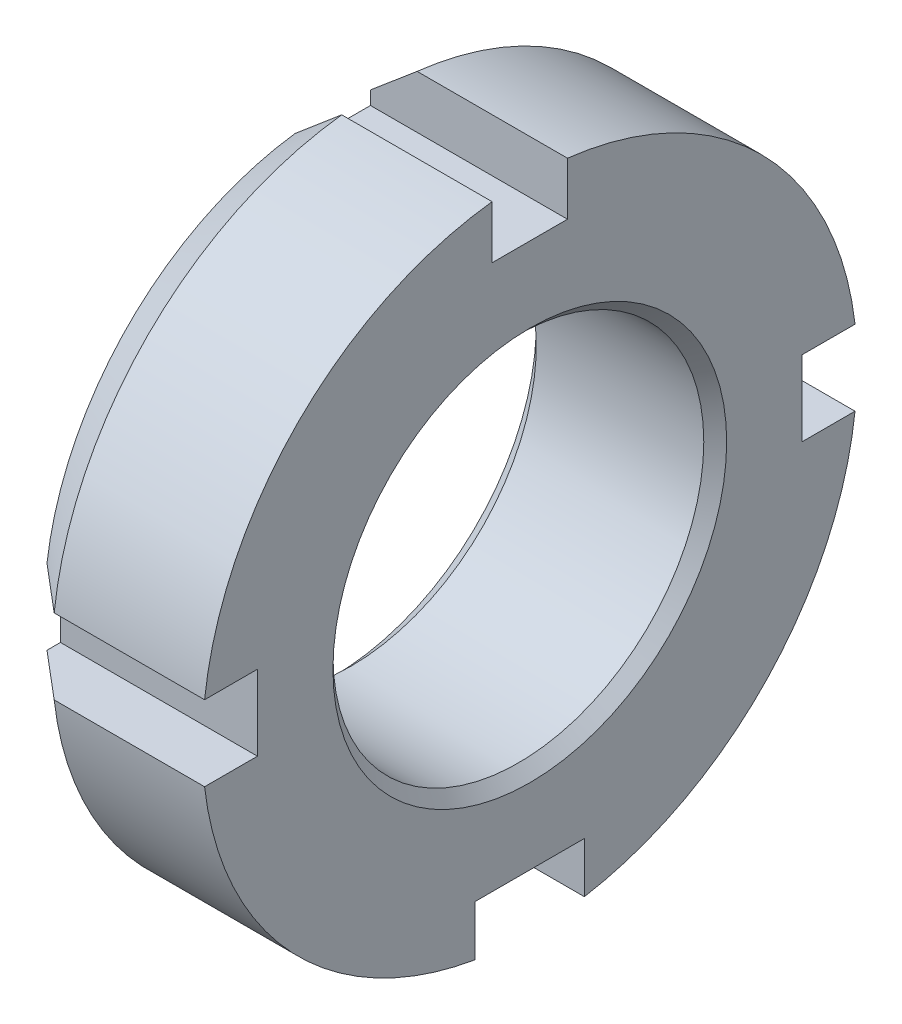
ISO-10303-21;
HEADER;
FILE_DESCRIPTION(('STEP AP214'),'2;1');
FILE_NAME('part.step','',(''),(''),'','','');
FILE_SCHEMA(('AUTOMOTIVE_DESIGN { 1 0 10303 214 1 1 1 1 }'));
ENDSEC;
DATA;
#1=APPLICATION_CONTEXT('core data for automotive mechanical design processes');
#2=APPLICATION_PROTOCOL_DEFINITION('international standard','automotive_design',2000,#1);
#3=PRODUCT_CONTEXT('',#1,'mechanical');
#4=PRODUCT('Part','Part','',(#3));
#5=PRODUCT_RELATED_PRODUCT_CATEGORY('part','',(#4));
#6=PRODUCT_DEFINITION_FORMATION('','',#4);
#7=PRODUCT_DEFINITION_CONTEXT('part definition',#1,'design');
#8=PRODUCT_DEFINITION('design','',#6,#7);
#9=PRODUCT_DEFINITION_SHAPE('','',#8);
#10=(LENGTH_UNIT() NAMED_UNIT(*) SI_UNIT(.MILLI.,.METRE.));
#11=(NAMED_UNIT(*) PLANE_ANGLE_UNIT() SI_UNIT($,.RADIAN.));
#12=(NAMED_UNIT(*) SI_UNIT($,.STERADIAN.) SOLID_ANGLE_UNIT());
#13=UNCERTAINTY_MEASURE_WITH_UNIT(LENGTH_MEASURE(1.E-05),#10,'distance_accuracy_value','');
#14=(GEOMETRIC_REPRESENTATION_CONTEXT(3) GLOBAL_UNCERTAINTY_ASSIGNED_CONTEXT((#13)) GLOBAL_UNIT_ASSIGNED_CONTEXT((#10,
#11,#12)) REPRESENTATION_CONTEXT('',''));
#15=CARTESIAN_POINT('',(0.,0.,0.));
#16=DIRECTION('',(0.,0.,1.));
#17=DIRECTION('',(1.,0.,0.));
#18=AXIS2_PLACEMENT_3D('',#15,#16,#17);
#19=CARTESIAN_POINT('',(0.,0.,0.));
#20=DIRECTION('',(1.,0.,0.));
#21=DIRECTION('',(0.,0.,-1.));
#22=AXIS2_PLACEMENT_3D('',#19,#20,#21);
#23=PLANE('',#22);
#24=CARTESIAN_POINT('',(0.,0.,0.));
#25=DIRECTION('',(-1.,0.,0.));
#26=DIRECTION('',(0.,0.,1.));
#27=AXIS2_PLACEMENT_3D('',#24,#25,#26);
#28=CIRCLE('',#27,2.54);
#29=CARTESIAN_POINT('',(0.,0.,2.54));
#30=VERTEX_POINT('',#29);
#31=EDGE_CURVE('P0_E17',#30,#30,#28,.F.);
#32=ORIENTED_EDGE('',*,*,#31,.F.);
#33=EDGE_LOOP('',(#32));
#34=FACE_BOUND('',#33,.T.);
#35=ADVANCED_FACE('P0_F14',(#34),#23,.F.);
#36=CARTESIAN_POINT('',(0.254,0.,0.));
#37=DIRECTION('',(-1.,0.,0.));
#38=DIRECTION('',(0.,0.,1.));
#39=AXIS2_PLACEMENT_3D('',#36,#37,#38);
#40=CYLINDRICAL_SURFACE('',#39,2.54);
#41=ORIENTED_EDGE('',*,*,#31,.T.);
#42=EDGE_LOOP('',(#41));
#43=FACE_BOUND('',#42,.T.);
#44=CARTESIAN_POINT('',(0.254,0.,0.));
#45=DIRECTION('',(-1.,0.,0.));
#46=DIRECTION('',(0.,0.,1.));
#47=AXIS2_PLACEMENT_3D('',#44,#45,#46);
#48=CIRCLE('',#47,2.54);
#49=CARTESIAN_POINT('',(0.254,0.,2.54));
#50=VERTEX_POINT('',#49);
#51=EDGE_CURVE('P0_E10',#50,#50,#48,.F.);
#52=ORIENTED_EDGE('',*,*,#51,.F.);
#53=EDGE_LOOP('',(#52));
#54=FACE_BOUND('',#53,.T.);
#55=ADVANCED_FACE('P0_F26',(#43,#54),#40,.T.);
#56=CARTESIAN_POINT('',(0.254,0.,0.));
#57=DIRECTION('',(1.,0.,0.));
#58=DIRECTION('',(0.,0.,-1.));
#59=AXIS2_PLACEMENT_3D('',#56,#57,#58);
#60=PLANE('',#59);
#61=ORIENTED_EDGE('',*,*,#51,.T.);
#62=EDGE_LOOP('',(#61));
#63=FACE_BOUND('',#62,.T.);
#64=ADVANCED_FACE('P0_F34',(#63),#60,.T.);
#65=CLOSED_SHELL('',(#35,#55,#64));
#66=MANIFOLD_SOLID_BREP('P0_B1',#65);
#67=CARTESIAN_POINT('',(0.,0.,0.));
#68=DIRECTION('',(-1.,0.,0.));
#69=DIRECTION('',(0.,-1.,0.));
#70=AXIS2_PLACEMENT_3D('',#67,#68,#69);
#71=CONICAL_SURFACE('',#70,8.92175000000001,0.785398163397454);
#72=CARTESIAN_POINT('',(0.,0.,0.));
#73=DIRECTION('',(-1.,0.,0.));
#74=DIRECTION('',(0.,-1.,0.));
#75=AXIS2_PLACEMENT_3D('',#72,#73,#74);
#76=CIRCLE('',#75,8.92175000000001);
#77=CARTESIAN_POINT('',(0.,-8.92175000000001,0.));
#78=VERTEX_POINT('',#77);
#79=EDGE_CURVE('P1_E202',#78,#78,#76,.T.);
#80=ORIENTED_EDGE('',*,*,#79,.T.);
#81=EDGE_LOOP('',(#80));
#82=FACE_BOUND('',#81,.T.);
#83=CARTESIAN_POINT('',(0.793750000000002,0.,0.));
#84=DIRECTION('',(-1.,0.,0.));
#85=DIRECTION('',(0.,0.,1.));
#86=AXIS2_PLACEMENT_3D('',#83,#84,#85);
#87=CIRCLE('',#86,8.128);
#88=CARTESIAN_POINT('',(0.793750000000002,0.,8.128));
#89=VERTEX_POINT('',#88);
#90=EDGE_CURVE('P1_E263',#89,#89,#87,.F.);
#91=ORIENTED_EDGE('',*,*,#90,.T.);
#92=EDGE_LOOP('',(#91));
#93=FACE_BOUND('',#92,.T.);
#94=ADVANCED_FACE('P1_F16',(#82,#93),#71,.F.);
#95=CARTESIAN_POINT('',(2.04326153450278,0.,0.));
#96=DIRECTION('',(1.,0.,0.));
#97=DIRECTION('',(0.,1.,0.));
#98=AXIS2_PLACEMENT_3D('',#95,#96,#97);
#99=CONICAL_SURFACE('',#98,14.351,0.698131700797725);
#100=CARTESIAN_POINT('',(0.,0.,0.));
#101=DIRECTION('',(1.,0.,0.));
#102=DIRECTION('',(0.,1.,0.));
#103=AXIS2_PLACEMENT_3D('',#100,#101,#102);
#104=CIRCLE('',#103,12.6365);
#105=CARTESIAN_POINT('',(0.,12.5281814821626,1.651));
#106=VERTEX_POINT('',#105);
#107=CARTESIAN_POINT('',(0.,1.651,12.5281814821626));
#108=VERTEX_POINT('',#107);
#109=EDGE_CURVE('P1_E203',#106,#108,#104,.T.);
#110=ORIENTED_EDGE('',*,*,#109,.T.);
#111=CARTESIAN_POINT('',(0.,1.651,12.5281814821625));
#112=CARTESIAN_POINT('',(0.340405958390028,1.651,12.8162664626746));
#113=CARTESIAN_POINT('',(0.680880732745143,1.651,13.1042700502399));
#114=CARTESIAN_POINT('',(1.36196791091373,1.651,13.6801144373874));
#115=CARTESIAN_POINT('',(1.70258031472621,1.651,13.9679552369708));
#116=CARTESIAN_POINT('',(2.04326153450278,1.651,14.2557146436087));
#117=B_SPLINE_CURVE_WITH_KNOTS('',3,(#111,#112,#113,#114,#115,#116),.UNSPECIFIED.,.F.,.F.,(4,2,
4),(0.,1.33784238451476,2.67568475931881),.UNSPECIFIED.);
#118=CARTESIAN_POINT('',(2.04326153450278,1.651,14.2557146436087));
#119=VERTEX_POINT('',#118);
#120=EDGE_CURVE('P1_E173',#108,#119,#117,.T.);
#121=ORIENTED_EDGE('',*,*,#120,.T.);
#122=CARTESIAN_POINT('',(2.04326153450278,0.,0.));
#123=DIRECTION('',(-1.,0.,0.));
#124=DIRECTION('',(0.,0.,1.));
#125=AXIS2_PLACEMENT_3D('',#122,#123,#124);
#126=CIRCLE('',#125,14.351);
#127=CARTESIAN_POINT('',(2.04326153450278,14.2557146436087,1.651));
#128=VERTEX_POINT('',#127);
#129=EDGE_CURVE('P1_E252',#128,#119,#126,.F.);
#130=ORIENTED_EDGE('',*,*,#129,.F.);
#131=CARTESIAN_POINT('',(2.04326153450278,14.2557146436087,1.651));
#132=CARTESIAN_POINT('',(1.70258031472621,13.9679552369708,1.651));
#133=CARTESIAN_POINT('',(1.36196791091374,13.6801144373875,1.651));
#134=CARTESIAN_POINT('',(0.680880732745155,13.1042700502399,1.651));
#135=CARTESIAN_POINT('',(0.340405958390043,12.8162664626746,1.651));
#136=CARTESIAN_POINT('',(0.,12.5281814821626,1.651));
#137=B_SPLINE_CURVE_WITH_KNOTS('',3,(#131,#132,#133,#134,#135,#136),.UNSPECIFIED.,.F.,.F.,(4,2,
4),(0.,1.33784237480403,2.67568475931878),.UNSPECIFIED.);
#138=EDGE_CURVE('P1_E249',#128,#106,#137,.T.);
#139=ORIENTED_EDGE('',*,*,#138,.T.);
#140=EDGE_LOOP('',(#110,#121,#130,#139));
#141=FACE_BOUND('',#140,.T.);
#142=ADVANCED_FACE('P1_F351',(#141),#99,.T.);
#143=CARTESIAN_POINT('',(2.04326153450278,0.,0.));
#144=DIRECTION('',(1.,0.,0.));
#145=DIRECTION('',(0.,1.,0.));
#146=AXIS2_PLACEMENT_3D('',#143,#144,#145);
#147=CONICAL_SURFACE('',#146,14.351,0.698131700797725);
#148=CARTESIAN_POINT('',(2.04326153450278,0.,0.));
#149=DIRECTION('',(-1.,0.,0.));
#150=DIRECTION('',(0.,0.,1.));
#151=AXIS2_PLACEMENT_3D('',#148,#149,#150);
#152=CIRCLE('',#151,14.351);
#153=CARTESIAN_POINT('',(2.04326153450278,1.651,-14.2557146436087));
#154=VERTEX_POINT('',#153);
#155=CARTESIAN_POINT('',(2.04326153450278,14.2557146436087,-1.651));
#156=VERTEX_POINT('',#155);
#157=EDGE_CURVE('P1_E231',#154,#156,#152,.F.);
#158=ORIENTED_EDGE('',*,*,#157,.F.);
#159=CARTESIAN_POINT('',(2.04326153450278,1.651,-14.2557146436087));
#160=CARTESIAN_POINT('',(1.70258031472621,1.651,-13.9679552369708));
#161=CARTESIAN_POINT('',(1.36196791091374,1.651,-13.6801144373875));
#162=CARTESIAN_POINT('',(0.680880732745155,1.651,-13.1042700502399));
#163=CARTESIAN_POINT('',(0.340405958390043,1.651,-12.8162664626746));
#164=CARTESIAN_POINT('',(0.,1.651,-12.5281814821626));
#165=B_SPLINE_CURVE_WITH_KNOTS('',3,(#159,#160,#161,#162,#163,#164),.UNSPECIFIED.,.F.,.F.,(4,2,
4),(0.,1.33784237480403,2.67568475931878),.UNSPECIFIED.);
#166=CARTESIAN_POINT('',(0.,1.651,-12.5281814821626));
#167=VERTEX_POINT('',#166);
#168=EDGE_CURVE('P1_E228',#154,#167,#165,.T.);
#169=ORIENTED_EDGE('',*,*,#168,.T.);
#170=CARTESIAN_POINT('',(0.,0.,0.));
#171=DIRECTION('',(1.,0.,0.));
#172=DIRECTION('',(0.,1.,0.));
#173=AXIS2_PLACEMENT_3D('',#170,#171,#172);
#174=CIRCLE('',#173,12.6365);
#175=CARTESIAN_POINT('',(0.,12.5281814821626,-1.651));
#176=VERTEX_POINT('',#175);
#177=EDGE_CURVE('P1_E508',#167,#176,#174,.T.);
#178=ORIENTED_EDGE('',*,*,#177,.T.);
#179=CARTESIAN_POINT('',(0.,12.5281814821625,-1.651));
#180=CARTESIAN_POINT('',(0.340405958390028,12.8162664626746,-1.651));
#181=CARTESIAN_POINT('',(0.680880732745143,13.1042700502399,-1.651));
#182=CARTESIAN_POINT('',(1.36196791091373,13.6801144373874,-1.651));
#183=CARTESIAN_POINT('',(1.7025803147262,13.9679552369708,-1.651));
#184=CARTESIAN_POINT('',(2.04326153450277,14.2557146436087,-1.651));
#185=B_SPLINE_CURVE_WITH_KNOTS('',3,(#179,#180,#181,#182,#183,#184),.UNSPECIFIED.,.F.,.F.,(4,2,
4),(0.,1.33784238451476,2.6756847593188),.UNSPECIFIED.);
#186=EDGE_CURVE('P1_E242',#176,#156,#185,.T.);
#187=ORIENTED_EDGE('',*,*,#186,.T.);
#188=EDGE_LOOP('',(#158,#169,#178,#187));
#189=FACE_BOUND('',#188,.T.);
#190=ADVANCED_FACE('P1_F354',(#189),#147,.T.);
#191=CARTESIAN_POINT('',(2.04326153450278,0.,0.));
#192=DIRECTION('',(1.,0.,0.));
#193=DIRECTION('',(0.,0.,-1.));
#194=AXIS2_PLACEMENT_3D('',#191,#192,#193);
#195=CONICAL_SURFACE('',#194,14.351,0.698131700797724);
#196=CARTESIAN_POINT('',(0.,0.,0.));
#197=DIRECTION('',(1.,0.,0.));
#198=DIRECTION('',(0.,0.,-1.));
#199=AXIS2_PLACEMENT_3D('',#196,#197,#198);
#200=CIRCLE('',#199,12.6365);
#201=CARTESIAN_POINT('',(0.,-12.4080725963203,-2.39183333333373));
#202=VERTEX_POINT('',#201);
#203=CARTESIAN_POINT('',(0.,-1.651,-12.5281814821625));
#204=VERTEX_POINT('',#203);
#205=EDGE_CURVE('P1_E19',#202,#204,#200,.T.);
#206=ORIENTED_EDGE('',*,*,#205,.T.);
#207=CARTESIAN_POINT('',(0.,-1.651,-12.5281814821625));
#208=CARTESIAN_POINT('',(0.340405958390026,-1.651,-12.8162664626746));
#209=CARTESIAN_POINT('',(0.680880732745142,-1.651,-13.1042700502399));
#210=CARTESIAN_POINT('',(1.36196791091373,-1.651,-13.6801144373874));
#211=CARTESIAN_POINT('',(1.70258031472621,-1.651,-13.9679552369708));
#212=CARTESIAN_POINT('',(2.04326153450278,-1.651,-14.2557146436087));
#213=B_SPLINE_CURVE_WITH_KNOTS('',3,(#207,#208,#209,#210,#211,#212),.UNSPECIFIED.,.F.,.F.,(4,2,
4),(0.,1.33784238451476,2.67568475931881),.UNSPECIFIED.);
#214=CARTESIAN_POINT('',(2.04326153450278,-1.651,-14.2557146436087));
#215=VERTEX_POINT('',#214);
#216=EDGE_CURVE('P1_E221',#204,#215,#213,.T.);
#217=ORIENTED_EDGE('',*,*,#216,.T.);
#218=CARTESIAN_POINT('',(2.04326153450278,0.,0.));
#219=DIRECTION('',(-1.,0.,0.));
#220=DIRECTION('',(0.,0.,1.));
#221=AXIS2_PLACEMENT_3D('',#218,#219,#220);
#222=CIRCLE('',#221,14.351);
#223=CARTESIAN_POINT('',(2.04326153450278,-14.150276827877,-2.39183333333373));
#224=VERTEX_POINT('',#223);
#225=EDGE_CURVE('P1_E211',#224,#215,#222,.F.);
#226=ORIENTED_EDGE('',*,*,#225,.F.);
#227=CARTESIAN_POINT('',(2.04326153450278,-14.150276827877,-2.39183333333373));
#228=CARTESIAN_POINT('',(1.70242124266067,-13.8602574411366,-2.39183333333373));
#229=CARTESIAN_POINT('',(1.36172930501916,-13.5700640642141,-2.39183333333373));
#230=CARTESIAN_POINT('',(0.680642126841729,-12.9893293203734,-2.39183333333373));
#231=CARTESIAN_POINT('',(0.340246886315648,-12.6987879534437,-2.39183333333373));
#232=CARTESIAN_POINT('',(0.,-12.4080725963203,-2.39183333333373));
#233=B_SPLINE_CURVE_WITH_KNOTS('',3,(#227,#228,#229,#230,#231,#232),.UNSPECIFIED.,.F.,.F.,(4,2,
4),(0.,1.34259030662849,2.68518065778987),.UNSPECIFIED.);
#234=EDGE_CURVE('P1_E208',#224,#202,#233,.T.);
#235=ORIENTED_EDGE('',*,*,#234,.T.);
#236=EDGE_LOOP('',(#206,#217,#226,#235));
#237=FACE_BOUND('',#236,.T.);
#238=ADVANCED_FACE('P1_F359',(#237),#195,.T.);
#239=CARTESIAN_POINT('',(0.,12.6365,0.));
#240=DIRECTION('',(1.,0.,0.));
#241=DIRECTION('',(0.,0.,-1.));
#242=AXIS2_PLACEMENT_3D('',#239,#240,#241);
#243=PLANE('',#242);
#244=ORIENTED_EDGE('',*,*,#79,.F.);
#245=EDGE_LOOP('',(#244));
#246=FACE_BOUND('',#245,.T.);
#247=DIRECTION('',(0.,1.,0.));
#248=VECTOR('',#247,1.);
#249=CARTESIAN_POINT('',(0.,12.6365,2.39183333333372));
#250=LINE('',#249,#248);
#251=CARTESIAN_POINT('',(0.,-12.4080725963203,2.39183333333372));
#252=VERTEX_POINT('',#251);
#253=CARTESIAN_POINT('',(0.,-11.938,2.39183333333372));
#254=VERTEX_POINT('',#253);
#255=EDGE_CURVE('P1_E199',#252,#254,#250,.T.);
#256=ORIENTED_EDGE('',*,*,#255,.F.);
#257=CARTESIAN_POINT('',(0.,0.,0.));
#258=DIRECTION('',(1.,0.,0.));
#259=DIRECTION('',(0.,0.,-1.));
#260=AXIS2_PLACEMENT_3D('',#257,#258,#259);
#261=CIRCLE('',#260,12.6365);
#262=CARTESIAN_POINT('',(0.,-1.651,12.5281814821625));
#263=VERTEX_POINT('',#262);
#264=EDGE_CURVE('P1_E160',#263,#252,#261,.T.);
#265=ORIENTED_EDGE('',*,*,#264,.F.);
#266=DIRECTION('',(0.,0.,-1.));
#267=VECTOR('',#266,1.);
#268=CARTESIAN_POINT('',(0.,-1.651,14.2557146436087));
#269=LINE('',#268,#267);
#270=CARTESIAN_POINT('',(0.,-1.651,11.938));
#271=VERTEX_POINT('',#270);
#272=EDGE_CURVE('P1_E153',#263,#271,#269,.T.);
#273=ORIENTED_EDGE('',*,*,#272,.T.);
#274=DIRECTION('',(0.,1.,0.));
#275=VECTOR('',#274,1.);
#276=CARTESIAN_POINT('',(0.,1.651,11.938));
#277=LINE('',#276,#275);
#278=CARTESIAN_POINT('',(0.,1.651,11.938));
#279=VERTEX_POINT('',#278);
#280=EDGE_CURVE('P1_E157',#271,#279,#277,.T.);
#281=ORIENTED_EDGE('',*,*,#280,.T.);
#282=DIRECTION('',(0.,0.,1.));
#283=VECTOR('',#282,1.);
#284=CARTESIAN_POINT('',(0.,1.651,14.2557146436087));
#285=LINE('',#284,#283);
#286=EDGE_CURVE('P1_E255',#279,#108,#285,.T.);
#287=ORIENTED_EDGE('',*,*,#286,.T.);
#288=ORIENTED_EDGE('',*,*,#109,.F.);
#289=DIRECTION('',(0.,-1.,0.));
#290=VECTOR('',#289,1.);
#291=CARTESIAN_POINT('',(0.,14.2557146436087,1.651));
#292=LINE('',#291,#290);
#293=CARTESIAN_POINT('',(0.,11.938,1.651));
#294=VERTEX_POINT('',#293);
#295=EDGE_CURVE('P1_E246',#106,#294,#292,.T.);
#296=ORIENTED_EDGE('',*,*,#295,.T.);
#297=DIRECTION('',(0.,0.,-1.));
#298=VECTOR('',#297,1.);
#299=CARTESIAN_POINT('',(0.,11.938,1.651));
#300=LINE('',#299,#298);
#301=CARTESIAN_POINT('',(0.,11.938,-1.651));
#302=VERTEX_POINT('',#301);
#303=EDGE_CURVE('P1_E240',#294,#302,#300,.T.);
#304=ORIENTED_EDGE('',*,*,#303,.T.);
#305=DIRECTION('',(0.,1.,0.));
#306=VECTOR('',#305,1.);
#307=CARTESIAN_POINT('',(0.,14.2557146436087,-1.651));
#308=LINE('',#307,#306);
#309=EDGE_CURVE('P1_E234',#302,#176,#308,.T.);
#310=ORIENTED_EDGE('',*,*,#309,.T.);
#311=ORIENTED_EDGE('',*,*,#177,.F.);
#312=DIRECTION('',(0.,0.,1.));
#313=VECTOR('',#312,1.);
#314=CARTESIAN_POINT('',(0.,1.651,-11.938));
#315=LINE('',#314,#313);
#316=CARTESIAN_POINT('',(0.,1.651,-11.938));
#317=VERTEX_POINT('',#316);
#318=EDGE_CURVE('P1_E225',#167,#317,#315,.T.);
#319=ORIENTED_EDGE('',*,*,#318,.T.);
#320=DIRECTION('',(0.,1.,0.));
#321=VECTOR('',#320,1.);
#322=CARTESIAN_POINT('',(0.,1.651,-11.938));
#323=LINE('',#322,#321);
#324=CARTESIAN_POINT('',(0.,-1.651,-11.938));
#325=VERTEX_POINT('',#324);
#326=EDGE_CURVE('P1_E219',#317,#325,#323,.F.);
#327=ORIENTED_EDGE('',*,*,#326,.T.);
#328=DIRECTION('',(0.,0.,-1.));
#329=VECTOR('',#328,1.);
#330=CARTESIAN_POINT('',(0.,-1.651,-11.938));
#331=LINE('',#330,#329);
#332=EDGE_CURVE('P1_E214',#325,#204,#331,.T.);
#333=ORIENTED_EDGE('',*,*,#332,.T.);
#334=ORIENTED_EDGE('',*,*,#205,.F.);
#335=DIRECTION('',(0.,1.,0.));
#336=VECTOR('',#335,1.);
#337=CARTESIAN_POINT('',(0.,-11.938,-2.39183333333373));
#338=LINE('',#337,#336);
#339=CARTESIAN_POINT('',(0.,-11.938,-2.39183333333373));
#340=VERTEX_POINT('',#339);
#341=EDGE_CURVE('P1_E126',#202,#340,#338,.T.);
#342=ORIENTED_EDGE('',*,*,#341,.T.);
#343=DIRECTION('',(0.,0.,1.));
#344=VECTOR('',#343,1.);
#345=CARTESIAN_POINT('',(0.,-11.938,2.39183333333372));
#346=LINE('',#345,#344);
#347=EDGE_CURVE('P1_E193',#340,#254,#346,.T.);
#348=ORIENTED_EDGE('',*,*,#347,.T.);
#349=EDGE_LOOP('',(#256,#265,#273,#281,#287,#288,#296,#304,#310,#311,#319,#327,#333,#334,#342,#348));
#350=FACE_BOUND('',#349,.T.);
#351=ADVANCED_FACE('P1_F155',(#246,#350),#243,.F.);
#352=CARTESIAN_POINT('',(2.04326153450278,0.,0.));
#353=DIRECTION('',(1.,0.,0.));
#354=DIRECTION('',(0.,0.,-1.));
#355=AXIS2_PLACEMENT_3D('',#352,#353,#354);
#356=CONICAL_SURFACE('',#355,14.351,0.698131700797724);
#357=CARTESIAN_POINT('',(2.04326153450278,0.,0.));
#358=DIRECTION('',(-1.,0.,0.));
#359=DIRECTION('',(0.,0.,1.));
#360=AXIS2_PLACEMENT_3D('',#357,#358,#359);
#361=CIRCLE('',#360,14.351);
#362=CARTESIAN_POINT('',(2.04326153450278,-1.651,14.2557146436087));
#363=VERTEX_POINT('',#362);
#364=CARTESIAN_POINT('',(2.04326153450278,-14.150276827877,2.39183333333372));
#365=VERTEX_POINT('',#364);
#366=EDGE_CURVE('P1_E190',#363,#365,#361,.F.);
#367=ORIENTED_EDGE('',*,*,#366,.F.);
#368=CARTESIAN_POINT('',(2.04326153450278,-1.651,14.2557146436087));
#369=CARTESIAN_POINT('',(1.70258031472621,-1.651,13.9679552369708));
#370=CARTESIAN_POINT('',(1.36196791091373,-1.651,13.6801144373874));
#371=CARTESIAN_POINT('',(0.68088073274514,-1.651,13.1042700502399));
#372=CARTESIAN_POINT('',(0.340405958390024,-1.651,12.8162664626745));
#373=CARTESIAN_POINT('',(0.,-1.651,12.5281814821625));
#374=B_SPLINE_CURVE_WITH_KNOTS('',3,(#368,#369,#370,#371,#372,#373),.UNSPECIFIED.,.F.,.F.,(4,2,
4),(0.,1.33784237480405,2.67568475931881),.UNSPECIFIED.);
#375=EDGE_CURVE('P1_E165',#363,#263,#374,.T.);
#376=ORIENTED_EDGE('',*,*,#375,.T.);
#377=ORIENTED_EDGE('',*,*,#264,.T.);
#378=CARTESIAN_POINT('',(0.,-12.4080725963203,2.39183333333372));
#379=CARTESIAN_POINT('',(0.340246886315647,-12.6987879534437,2.39183333333372));
#380=CARTESIAN_POINT('',(0.680642126841727,-12.9893293203734,2.39183333333372));
#381=CARTESIAN_POINT('',(1.36172930501916,-13.5700640642141,2.39183333333372));
#382=CARTESIAN_POINT('',(1.70242124266067,-13.8602574411366,2.39183333333372));
#383=CARTESIAN_POINT('',(2.04326153450278,-14.150276827877,2.39183333333372));
#384=B_SPLINE_CURVE_WITH_KNOTS('',3,(#378,#379,#380,#381,#382,#383),.UNSPECIFIED.,.F.,.F.,(4,2,
4),(0.,1.34259035116138,2.68518065778987),.UNSPECIFIED.);
#385=EDGE_CURVE('P1_E195',#252,#365,#384,.T.);
#386=ORIENTED_EDGE('',*,*,#385,.T.);
#387=EDGE_LOOP('',(#367,#376,#377,#386));
#388=FACE_BOUND('',#387,.T.);
#389=ADVANCED_FACE('P1_F300',(#388),#356,.T.);
#390=CARTESIAN_POINT('',(0.,0.,0.));
#391=DIRECTION('',(-1.,0.,0.));
#392=DIRECTION('',(0.,0.,1.));
#393=AXIS2_PLACEMENT_3D('',#390,#391,#392);
#394=CYLINDRICAL_SURFACE('',#393,8.128);
#395=ORIENTED_EDGE('',*,*,#90,.F.);
#396=EDGE_LOOP('',(#395));
#397=FACE_BOUND('',#396,.T.);
#398=CARTESIAN_POINT('',(8.13435,0.,0.));
#399=DIRECTION('',(1.,0.,0.));
#400=DIRECTION('',(0.,0.,-1.));
#401=AXIS2_PLACEMENT_3D('',#398,#399,#400);
#402=CIRCLE('',#401,8.128);
#403=CARTESIAN_POINT('',(8.13435,0.,-8.128));
#404=VERTEX_POINT('',#403);
#405=EDGE_CURVE('P1_E186',#404,#404,#402,.T.);
#406=ORIENTED_EDGE('',*,*,#405,.T.);
#407=EDGE_LOOP('',(#406));
#408=FACE_BOUND('',#407,.T.);
#409=ADVANCED_FACE('P1_F305',(#397,#408),#394,.F.);
#410=CARTESIAN_POINT('',(0.,-1.651,14.2557146436087));
#411=DIRECTION('',(0.,-1.,0.));
#412=DIRECTION('',(0.,0.,-1.));
#413=AXIS2_PLACEMENT_3D('',#410,#411,#412);
#414=PLANE('',#413);
#415=DIRECTION('',(0.,0.,1.));
#416=VECTOR('',#415,1.);
#417=CARTESIAN_POINT('',(8.63600000000002,-1.65099999999999,0.));
#418=LINE('',#417,#416);
#419=CARTESIAN_POINT('',(8.63600000000002,-1.65099999999999,14.2557146436087));
#420=VERTEX_POINT('',#419);
#421=CARTESIAN_POINT('',(8.63600000000002,-1.651,11.938));
#422=VERTEX_POINT('',#421);
#423=EDGE_CURVE('P1_E178',#420,#422,#418,.F.);
#424=ORIENTED_EDGE('',*,*,#423,.T.);
#425=DIRECTION('',(-1.,0.,0.));
#426=VECTOR('',#425,1.);
#427=CARTESIAN_POINT('',(0.,-1.651,11.938));
#428=LINE('',#427,#426);
#429=EDGE_CURVE('P1_E164',#422,#271,#428,.T.);
#430=ORIENTED_EDGE('',*,*,#429,.T.);
#431=ORIENTED_EDGE('',*,*,#272,.F.);
#432=ORIENTED_EDGE('',*,*,#375,.F.);
#433=DIRECTION('',(-1.,0.,0.));
#434=VECTOR('',#433,1.);
#435=CARTESIAN_POINT('',(0.,-1.651,14.2557146436087));
#436=LINE('',#435,#434);
#437=EDGE_CURVE('P1_E189',#420,#363,#436,.T.);
#438=ORIENTED_EDGE('',*,*,#437,.F.);
#439=EDGE_LOOP('',(#424,#430,#431,#432,#438));
#440=FACE_BOUND('',#439,.T.);
#441=ADVANCED_FACE('P1_F176',(#440),#414,.F.);
#442=CARTESIAN_POINT('',(0.,1.651,11.938));
#443=DIRECTION('',(0.,0.,-1.));
#444=DIRECTION('',(-1.,0.,0.));
#445=AXIS2_PLACEMENT_3D('',#442,#443,#444);
#446=PLANE('',#445);
#447=DIRECTION('',(1.,0.,0.));
#448=VECTOR('',#447,1.);
#449=CARTESIAN_POINT('',(0.,1.651,11.938));
#450=LINE('',#449,#448);
#451=CARTESIAN_POINT('',(8.63600000000002,1.651,11.938));
#452=VERTEX_POINT('',#451);
#453=EDGE_CURVE('P1_E172',#452,#279,#450,.F.);
#454=ORIENTED_EDGE('',*,*,#453,.T.);
#455=ORIENTED_EDGE('',*,*,#280,.F.);
#456=ORIENTED_EDGE('',*,*,#429,.F.);
#457=DIRECTION('',(0.,1.,0.));
#458=VECTOR('',#457,1.);
#459=CARTESIAN_POINT('',(8.63600000000002,14.351,11.938));
#460=LINE('',#459,#458);
#461=EDGE_CURVE('P1_E448',#422,#452,#460,.T.);
#462=ORIENTED_EDGE('',*,*,#461,.T.);
#463=EDGE_LOOP('',(#454,#455,#456,#462));
#464=FACE_BOUND('',#463,.T.);
#465=ADVANCED_FACE('P1_F169',(#464),#446,.F.);
#466=CARTESIAN_POINT('',(0.,1.651,14.2557146436087));
#467=DIRECTION('',(0.,1.,0.));
#468=DIRECTION('',(0.,0.,1.));
#469=AXIS2_PLACEMENT_3D('',#466,#467,#468);
#470=PLANE('',#469);
#471=ORIENTED_EDGE('',*,*,#453,.F.);
#472=DIRECTION('',(0.,0.,1.));
#473=VECTOR('',#472,1.);
#474=CARTESIAN_POINT('',(8.63600000000002,1.651,0.));
#475=LINE('',#474,#473);
#476=CARTESIAN_POINT('',(8.63600000000002,1.651,14.2557146436087));
#477=VERTEX_POINT('',#476);
#478=EDGE_CURVE('P1_E282',#452,#477,#475,.T.);
#479=ORIENTED_EDGE('',*,*,#478,.T.);
#480=DIRECTION('',(-1.,0.,0.));
#481=VECTOR('',#480,1.);
#482=CARTESIAN_POINT('',(0.,1.651,14.2557146436087));
#483=LINE('',#482,#481);
#484=EDGE_CURVE('P1_E254',#119,#477,#483,.F.);
#485=ORIENTED_EDGE('',*,*,#484,.F.);
#486=ORIENTED_EDGE('',*,*,#120,.F.);
#487=ORIENTED_EDGE('',*,*,#286,.F.);
#488=EDGE_LOOP('',(#471,#479,#485,#486,#487));
#489=FACE_BOUND('',#488,.T.);
#490=ADVANCED_FACE('P1_F325',(#489),#470,.F.);
#491=CARTESIAN_POINT('',(0.,0.,0.));
#492=DIRECTION('',(-1.,0.,0.));
#493=DIRECTION('',(0.,0.,1.));
#494=AXIS2_PLACEMENT_3D('',#491,#492,#493);
#495=CYLINDRICAL_SURFACE('',#494,14.351);
#496=ORIENTED_EDGE('',*,*,#129,.T.);
#497=ORIENTED_EDGE('',*,*,#484,.T.);
#498=CARTESIAN_POINT('',(8.63600000000002,0.,0.));
#499=DIRECTION('',(-1.,0.,0.));
#500=DIRECTION('',(0.,0.,1.));
#501=AXIS2_PLACEMENT_3D('',#498,#499,#500);
#502=CIRCLE('',#501,14.351);
#503=CARTESIAN_POINT('',(8.63600000000002,14.2557146436087,1.651));
#504=VERTEX_POINT('',#503);
#505=EDGE_CURVE('P1_E278',#477,#504,#502,.T.);
#506=ORIENTED_EDGE('',*,*,#505,.T.);
#507=DIRECTION('',(1.,0.,0.));
#508=VECTOR('',#507,1.);
#509=CARTESIAN_POINT('',(0.,14.2557146436087,1.651));
#510=LINE('',#509,#508);
#511=EDGE_CURVE('P1_E248',#504,#128,#510,.F.);
#512=ORIENTED_EDGE('',*,*,#511,.T.);
#513=EDGE_LOOP('',(#496,#497,#506,#512));
#514=FACE_BOUND('',#513,.T.);
#515=ADVANCED_FACE('P1_F329',(#514),#495,.T.);
#516=CARTESIAN_POINT('',(0.,14.2557146436087,1.651));
#517=DIRECTION('',(0.,0.,1.));
#518=DIRECTION('',(0.,-1.,0.));
#519=AXIS2_PLACEMENT_3D('',#516,#517,#518);
#520=PLANE('',#519);
#521=DIRECTION('',(0.,1.,0.));
#522=VECTOR('',#521,1.);
#523=CARTESIAN_POINT('',(8.63600000000002,14.351,1.651));
#524=LINE('',#523,#522);
#525=CARTESIAN_POINT('',(8.63600000000002,11.938,1.651));
#526=VERTEX_POINT('',#525);
#527=EDGE_CURVE('P1_E281',#504,#526,#524,.F.);
#528=ORIENTED_EDGE('',*,*,#527,.T.);
#529=DIRECTION('',(1.,0.,0.));
#530=VECTOR('',#529,1.);
#531=CARTESIAN_POINT('',(0.,11.938,1.651));
#532=LINE('',#531,#530);
#533=EDGE_CURVE('P1_E243',#526,#294,#532,.F.);
#534=ORIENTED_EDGE('',*,*,#533,.T.);
#535=ORIENTED_EDGE('',*,*,#295,.F.);
#536=ORIENTED_EDGE('',*,*,#138,.F.);
#537=ORIENTED_EDGE('',*,*,#511,.F.);
#538=EDGE_LOOP('',(#528,#534,#535,#536,#537));
#539=FACE_BOUND('',#538,.T.);
#540=ADVANCED_FACE('P1_F333',(#539),#520,.F.);
#541=CARTESIAN_POINT('',(0.,11.938,1.651));
#542=DIRECTION('',(0.,-1.,0.));
#543=DIRECTION('',(0.,0.,-1.));
#544=AXIS2_PLACEMENT_3D('',#541,#542,#543);
#545=PLANE('',#544);
#546=DIRECTION('',(1.,0.,0.));
#547=VECTOR('',#546,1.);
#548=CARTESIAN_POINT('',(0.,11.938,-1.651));
#549=LINE('',#548,#547);
#550=CARTESIAN_POINT('',(8.63600000000002,11.938,-1.651));
#551=VERTEX_POINT('',#550);
#552=EDGE_CURVE('P1_E237',#551,#302,#549,.F.);
#553=ORIENTED_EDGE('',*,*,#552,.T.);
#554=ORIENTED_EDGE('',*,*,#303,.F.);
#555=ORIENTED_EDGE('',*,*,#533,.F.);
#556=DIRECTION('',(0.,0.,1.));
#557=VECTOR('',#556,1.);
#558=CARTESIAN_POINT('',(8.63600000000002,11.938,0.));
#559=LINE('',#558,#557);
#560=EDGE_CURVE('P1_E439',#526,#551,#559,.F.);
#561=ORIENTED_EDGE('',*,*,#560,.T.);
#562=EDGE_LOOP('',(#553,#554,#555,#561));
#563=FACE_BOUND('',#562,.T.);
#564=ADVANCED_FACE('P1_F338',(#563),#545,.F.);
#565=CARTESIAN_POINT('',(0.,14.2557146436087,-1.651));
#566=DIRECTION('',(0.,0.,-1.));
#567=DIRECTION('',(0.,1.,0.));
#568=AXIS2_PLACEMENT_3D('',#565,#566,#567);
#569=PLANE('',#568);
#570=ORIENTED_EDGE('',*,*,#552,.F.);
#571=DIRECTION('',(0.,1.,0.));
#572=VECTOR('',#571,1.);
#573=CARTESIAN_POINT('',(8.63600000000002,14.351,-1.651));
#574=LINE('',#573,#572);
#575=CARTESIAN_POINT('',(8.63600000000002,14.2557146436087,-1.651));
#576=VERTEX_POINT('',#575);
#577=EDGE_CURVE('P1_E277',#551,#576,#574,.T.);
#578=ORIENTED_EDGE('',*,*,#577,.T.);
#579=DIRECTION('',(-1.,0.,0.));
#580=VECTOR('',#579,1.);
#581=CARTESIAN_POINT('',(0.,14.2557146436087,-1.651));
#582=LINE('',#581,#580);
#583=EDGE_CURVE('P1_E233',#156,#576,#582,.F.);
#584=ORIENTED_EDGE('',*,*,#583,.F.);
#585=ORIENTED_EDGE('',*,*,#186,.F.);
#586=ORIENTED_EDGE('',*,*,#309,.F.);
#587=EDGE_LOOP('',(#570,#578,#584,#585,#586));
#588=FACE_BOUND('',#587,.T.);
#589=ADVANCED_FACE('P1_F381',(#588),#569,.F.);
#590=CARTESIAN_POINT('',(0.,0.,0.));
#591=DIRECTION('',(-1.,0.,0.));
#592=DIRECTION('',(0.,0.,1.));
#593=AXIS2_PLACEMENT_3D('',#590,#591,#592);
#594=CYLINDRICAL_SURFACE('',#593,14.351);
#595=CARTESIAN_POINT('',(8.63600000000002,0.,0.));
#596=DIRECTION('',(-1.,0.,0.));
#597=DIRECTION('',(0.,0.,1.));
#598=AXIS2_PLACEMENT_3D('',#595,#596,#597);
#599=CIRCLE('',#598,14.351);
#600=CARTESIAN_POINT('',(8.63600000000002,1.651,-14.2557146436087));
#601=VERTEX_POINT('',#600);
#602=EDGE_CURVE('P1_E273',#576,#601,#599,.T.);
#603=ORIENTED_EDGE('',*,*,#602,.T.);
#604=DIRECTION('',(1.,0.,0.));
#605=VECTOR('',#604,1.);
#606=CARTESIAN_POINT('',(0.,1.651,-14.2557146436087));
#607=LINE('',#606,#605);
#608=EDGE_CURVE('P1_E227',#601,#154,#607,.F.);
#609=ORIENTED_EDGE('',*,*,#608,.T.);
#610=ORIENTED_EDGE('',*,*,#157,.T.);
#611=ORIENTED_EDGE('',*,*,#583,.T.);
#612=EDGE_LOOP('',(#603,#609,#610,#611));
#613=FACE_BOUND('',#612,.T.);
#614=ADVANCED_FACE('P1_F378',(#613),#594,.T.);
#615=CARTESIAN_POINT('',(0.,1.651,-11.938));
#616=DIRECTION('',(0.,1.,0.));
#617=DIRECTION('',(0.,0.,1.));
#618=AXIS2_PLACEMENT_3D('',#615,#616,#617);
#619=PLANE('',#618);
#620=DIRECTION('',(0.,0.,1.));
#621=VECTOR('',#620,1.);
#622=CARTESIAN_POINT('',(8.63600000000002,1.651,0.));
#623=LINE('',#622,#621);
#624=CARTESIAN_POINT('',(8.63600000000002,1.651,-11.938));
#625=VERTEX_POINT('',#624);
#626=EDGE_CURVE('P1_E276',#601,#625,#623,.T.);
#627=ORIENTED_EDGE('',*,*,#626,.T.);
#628=DIRECTION('',(1.,0.,0.));
#629=VECTOR('',#628,1.);
#630=CARTESIAN_POINT('',(0.,1.651,-11.938));
#631=LINE('',#630,#629);
#632=EDGE_CURVE('P1_E222',#625,#317,#631,.F.);
#633=ORIENTED_EDGE('',*,*,#632,.T.);
#634=ORIENTED_EDGE('',*,*,#318,.F.);
#635=ORIENTED_EDGE('',*,*,#168,.F.);
#636=ORIENTED_EDGE('',*,*,#608,.F.);
#637=EDGE_LOOP('',(#627,#633,#634,#635,#636));
#638=FACE_BOUND('',#637,.T.);
#639=ADVANCED_FACE('P1_F372',(#638),#619,.F.);
#640=CARTESIAN_POINT('',(0.,1.651,-11.938));
#641=DIRECTION('',(0.,0.,1.));
#642=DIRECTION('',(1.,0.,0.));
#643=AXIS2_PLACEMENT_3D('',#640,#641,#642);
#644=PLANE('',#643);
#645=DIRECTION('',(1.,0.,0.));
#646=VECTOR('',#645,1.);
#647=CARTESIAN_POINT('',(0.,-1.651,-11.938));
#648=LINE('',#647,#646);
#649=CARTESIAN_POINT('',(8.63600000000002,-1.651,-11.938));
#650=VERTEX_POINT('',#649);
#651=EDGE_CURVE('P1_E216',#650,#325,#648,.F.);
#652=ORIENTED_EDGE('',*,*,#651,.T.);
#653=ORIENTED_EDGE('',*,*,#326,.F.);
#654=ORIENTED_EDGE('',*,*,#632,.F.);
#655=DIRECTION('',(0.,1.,0.));
#656=VECTOR('',#655,1.);
#657=CARTESIAN_POINT('',(8.63600000000002,14.351,-11.938));
#658=LINE('',#657,#656);
#659=EDGE_CURVE('P1_E430',#625,#650,#658,.F.);
#660=ORIENTED_EDGE('',*,*,#659,.T.);
#661=EDGE_LOOP('',(#652,#653,#654,#660));
#662=FACE_BOUND('',#661,.T.);
#663=ADVANCED_FACE('P1_F377',(#662),#644,.F.);
#664=CARTESIAN_POINT('',(0.,-1.651,-11.938));
#665=DIRECTION('',(0.,-1.,0.));
#666=DIRECTION('',(0.,0.,-1.));
#667=AXIS2_PLACEMENT_3D('',#664,#665,#666);
#668=PLANE('',#667);
#669=ORIENTED_EDGE('',*,*,#651,.F.);
#670=DIRECTION('',(0.,0.,1.));
#671=VECTOR('',#670,1.);
#672=CARTESIAN_POINT('',(8.63600000000002,-1.651,0.));
#673=LINE('',#672,#671);
#674=CARTESIAN_POINT('',(8.63600000000002,-1.651,-14.2557146436087));
#675=VERTEX_POINT('',#674);
#676=EDGE_CURVE('P1_E272',#650,#675,#673,.F.);
#677=ORIENTED_EDGE('',*,*,#676,.T.);
#678=DIRECTION('',(-1.,0.,0.));
#679=VECTOR('',#678,1.);
#680=CARTESIAN_POINT('',(0.,-1.651,-14.2557146436087));
#681=LINE('',#680,#679);
#682=EDGE_CURVE('P1_E213',#215,#675,#681,.F.);
#683=ORIENTED_EDGE('',*,*,#682,.F.);
#684=ORIENTED_EDGE('',*,*,#216,.F.);
#685=ORIENTED_EDGE('',*,*,#332,.F.);
#686=EDGE_LOOP('',(#669,#677,#683,#684,#685));
#687=FACE_BOUND('',#686,.T.);
#688=ADVANCED_FACE('P1_F538',(#687),#668,.F.);
#689=CARTESIAN_POINT('',(0.,0.,0.));
#690=DIRECTION('',(-1.,0.,0.));
#691=DIRECTION('',(0.,0.,1.));
#692=AXIS2_PLACEMENT_3D('',#689,#690,#691);
#693=CYLINDRICAL_SURFACE('',#692,14.351);
#694=ORIENTED_EDGE('',*,*,#225,.T.);
#695=ORIENTED_EDGE('',*,*,#682,.T.);
#696=CARTESIAN_POINT('',(8.63600000000002,0.,0.));
#697=DIRECTION('',(-1.,0.,0.));
#698=DIRECTION('',(0.,0.,1.));
#699=AXIS2_PLACEMENT_3D('',#696,#697,#698);
#700=CIRCLE('',#699,14.351);
#701=CARTESIAN_POINT('',(8.63600000000002,-14.150276827877,-2.39183333333373));
#702=VERTEX_POINT('',#701);
#703=EDGE_CURVE('P1_E268',#675,#702,#700,.T.);
#704=ORIENTED_EDGE('',*,*,#703,.T.);
#705=DIRECTION('',(1.,0.,0.));
#706=VECTOR('',#705,1.);
#707=CARTESIAN_POINT('',(0.,-14.150276827877,-2.39183333333373));
#708=LINE('',#707,#706);
#709=EDGE_CURVE('P1_E207',#702,#224,#708,.F.);
#710=ORIENTED_EDGE('',*,*,#709,.T.);
#711=EDGE_LOOP('',(#694,#695,#704,#710));
#712=FACE_BOUND('',#711,.T.);
#713=ADVANCED_FACE('P1_F532',(#712),#693,.T.);
#714=CARTESIAN_POINT('',(0.,-11.938,-2.39183333333373));
#715=DIRECTION('',(0.,0.,-1.));
#716=DIRECTION('',(0.,1.,0.));
#717=AXIS2_PLACEMENT_3D('',#714,#715,#716);
#718=PLANE('',#717);
#719=DIRECTION('',(0.,1.,0.));
#720=VECTOR('',#719,1.);
#721=CARTESIAN_POINT('',(8.63600000000002,14.351,-2.39183333333373));
#722=LINE('',#721,#720);
#723=CARTESIAN_POINT('',(8.63600000000002,-11.938,-2.39183333333373));
#724=VERTEX_POINT('',#723);
#725=EDGE_CURVE('P1_E271',#702,#724,#722,.T.);
#726=ORIENTED_EDGE('',*,*,#725,.T.);
#727=DIRECTION('',(1.,0.,0.));
#728=VECTOR('',#727,1.);
#729=CARTESIAN_POINT('',(0.,-11.938,-2.39183333333373));
#730=LINE('',#729,#728);
#731=EDGE_CURVE('P1_E196',#724,#340,#730,.F.);
#732=ORIENTED_EDGE('',*,*,#731,.T.);
#733=ORIENTED_EDGE('',*,*,#341,.F.);
#734=ORIENTED_EDGE('',*,*,#234,.F.);
#735=ORIENTED_EDGE('',*,*,#709,.F.);
#736=EDGE_LOOP('',(#726,#732,#733,#734,#735));
#737=FACE_BOUND('',#736,.T.);
#738=ADVANCED_FACE('P1_F528',(#737),#718,.F.);
#739=CARTESIAN_POINT('',(0.,-11.938,2.39183333333372));
#740=DIRECTION('',(0.,1.,0.));
#741=DIRECTION('',(0.,0.,1.));
#742=AXIS2_PLACEMENT_3D('',#739,#740,#741);
#743=PLANE('',#742);
#744=DIRECTION('',(1.,0.,0.));
#745=VECTOR('',#744,1.);
#746=CARTESIAN_POINT('',(0.,-11.938,2.39183333333372));
#747=LINE('',#746,#745);
#748=CARTESIAN_POINT('',(8.63600000000002,-11.938,2.39183333333372));
#749=VERTEX_POINT('',#748);
#750=EDGE_CURVE('P1_E192',#749,#254,#747,.F.);
#751=ORIENTED_EDGE('',*,*,#750,.T.);
#752=ORIENTED_EDGE('',*,*,#347,.F.);
#753=ORIENTED_EDGE('',*,*,#731,.F.);
#754=DIRECTION('',(0.,0.,1.));
#755=VECTOR('',#754,1.);
#756=CARTESIAN_POINT('',(8.63600000000002,-11.938,0.));
#757=LINE('',#756,#755);
#758=EDGE_CURVE('P1_E418',#724,#749,#757,.T.);
#759=ORIENTED_EDGE('',*,*,#758,.T.);
#760=EDGE_LOOP('',(#751,#752,#753,#759));
#761=FACE_BOUND('',#760,.T.);
#762=ADVANCED_FACE('P1_F408',(#761),#743,.F.);
#763=CARTESIAN_POINT('',(0.,-11.938,2.39183333333372));
#764=DIRECTION('',(0.,0.,1.));
#765=DIRECTION('',(0.,-1.,0.));
#766=AXIS2_PLACEMENT_3D('',#763,#764,#765);
#767=PLANE('',#766);
#768=ORIENTED_EDGE('',*,*,#750,.F.);
#769=DIRECTION('',(0.,1.,0.));
#770=VECTOR('',#769,1.);
#771=CARTESIAN_POINT('',(8.63600000000002,14.351,2.39183333333372));
#772=LINE('',#771,#770);
#773=CARTESIAN_POINT('',(8.63600000000002,-14.150276827877,2.39183333333372));
#774=VERTEX_POINT('',#773);
#775=EDGE_CURVE('P1_E267',#749,#774,#772,.F.);
#776=ORIENTED_EDGE('',*,*,#775,.T.);
#777=DIRECTION('',(-1.,0.,0.));
#778=VECTOR('',#777,1.);
#779=CARTESIAN_POINT('',(0.,-14.150276827877,2.39183333333371));
#780=LINE('',#779,#778);
#781=EDGE_CURVE('P1_E34',#365,#774,#780,.F.);
#782=ORIENTED_EDGE('',*,*,#781,.F.);
#783=ORIENTED_EDGE('',*,*,#385,.F.);
#784=ORIENTED_EDGE('',*,*,#255,.T.);
#785=EDGE_LOOP('',(#768,#776,#782,#783,#784));
#786=FACE_BOUND('',#785,.T.);
#787=ADVANCED_FACE('P1_F296',(#786),#767,.F.);
#788=CARTESIAN_POINT('',(0.,0.,0.));
#789=DIRECTION('',(-1.,0.,0.));
#790=DIRECTION('',(0.,0.,1.));
#791=AXIS2_PLACEMENT_3D('',#788,#789,#790);
#792=CYLINDRICAL_SURFACE('',#791,14.351);
#793=CARTESIAN_POINT('',(8.63600000000002,0.,0.));
#794=DIRECTION('',(-1.,0.,0.));
#795=DIRECTION('',(0.,0.,1.));
#796=AXIS2_PLACEMENT_3D('',#793,#794,#795);
#797=CIRCLE('',#796,14.351);
#798=EDGE_CURVE('P1_E25',#774,#420,#797,.T.);
#799=ORIENTED_EDGE('',*,*,#798,.T.);
#800=ORIENTED_EDGE('',*,*,#437,.T.);
#801=ORIENTED_EDGE('',*,*,#366,.T.);
#802=ORIENTED_EDGE('',*,*,#781,.T.);
#803=EDGE_LOOP('',(#799,#800,#801,#802));
#804=FACE_BOUND('',#803,.T.);
#805=ADVANCED_FACE('P1_F399',(#804),#792,.T.);
#806=CARTESIAN_POINT('',(8.636,0.,0.));
#807=DIRECTION('',(1.,0.,0.));
#808=DIRECTION('',(0.,0.,-1.));
#809=AXIS2_PLACEMENT_3D('',#806,#807,#808);
#810=CONICAL_SURFACE('',#809,8.62965,0.785398163397445);
#811=CARTESIAN_POINT('',(8.636,0.,0.));
#812=DIRECTION('',(1.,0.,0.));
#813=DIRECTION('',(0.,0.,-1.));
#814=AXIS2_PLACEMENT_3D('',#811,#812,#813);
#815=CIRCLE('',#814,8.62965);
#816=CARTESIAN_POINT('',(8.636,0.,-8.62965));
#817=VERTEX_POINT('',#816);
#818=EDGE_CURVE('P1_E11',#817,#817,#815,.T.);
#819=ORIENTED_EDGE('',*,*,#818,.T.);
#820=EDGE_LOOP('',(#819));
#821=FACE_BOUND('',#820,.T.);
#822=ORIENTED_EDGE('',*,*,#405,.F.);
#823=EDGE_LOOP('',(#822));
#824=FACE_BOUND('',#823,.T.);
#825=ADVANCED_FACE('P1_F393',(#821,#824),#810,.F.);
#826=CARTESIAN_POINT('',(8.63600000000002,14.351,0.));
#827=DIRECTION('',(-1.,0.,0.));
#828=DIRECTION('',(0.,0.,1.));
#829=AXIS2_PLACEMENT_3D('',#826,#827,#828);
#830=PLANE('',#829);
#831=ORIENTED_EDGE('',*,*,#818,.F.);
#832=EDGE_LOOP('',(#831));
#833=FACE_BOUND('',#832,.T.);
#834=ORIENTED_EDGE('',*,*,#775,.F.);
#835=ORIENTED_EDGE('',*,*,#758,.F.);
#836=ORIENTED_EDGE('',*,*,#725,.F.);
#837=ORIENTED_EDGE('',*,*,#703,.F.);
#838=ORIENTED_EDGE('',*,*,#676,.F.);
#839=ORIENTED_EDGE('',*,*,#659,.F.);
#840=ORIENTED_EDGE('',*,*,#626,.F.);
#841=ORIENTED_EDGE('',*,*,#602,.F.);
#842=ORIENTED_EDGE('',*,*,#577,.F.);
#843=ORIENTED_EDGE('',*,*,#560,.F.);
#844=ORIENTED_EDGE('',*,*,#527,.F.);
#845=ORIENTED_EDGE('',*,*,#505,.F.);
#846=ORIENTED_EDGE('',*,*,#478,.F.);
#847=ORIENTED_EDGE('',*,*,#461,.F.);
#848=ORIENTED_EDGE('',*,*,#423,.F.);
#849=ORIENTED_EDGE('',*,*,#798,.F.);
#850=EDGE_LOOP('',(#834,#835,#836,#837,#838,#839,#840,#841,#842,#843,#844,#845,#846,#847,#848,#849));
#851=FACE_BOUND('',#850,.T.);
#852=ADVANCED_FACE('P1_F391',(#833,#851),#830,.F.);
#853=CLOSED_SHELL('',(#94,#142,#190,#238,#351,#389,#409,#441,#465,#490,#515,#540,#564,#589,#614,
#639,#663,#688,#713,#738,#762,#787,#805,#825,#852));
#854=MANIFOLD_SOLID_BREP('P1_B1',#853);
#855=ADVANCED_BREP_SHAPE_REPRESENTATION('',(#18,#66,#854),#14);
#856=SHAPE_DEFINITION_REPRESENTATION(#9,#855);
ENDSEC;
END-ISO-10303-21;
